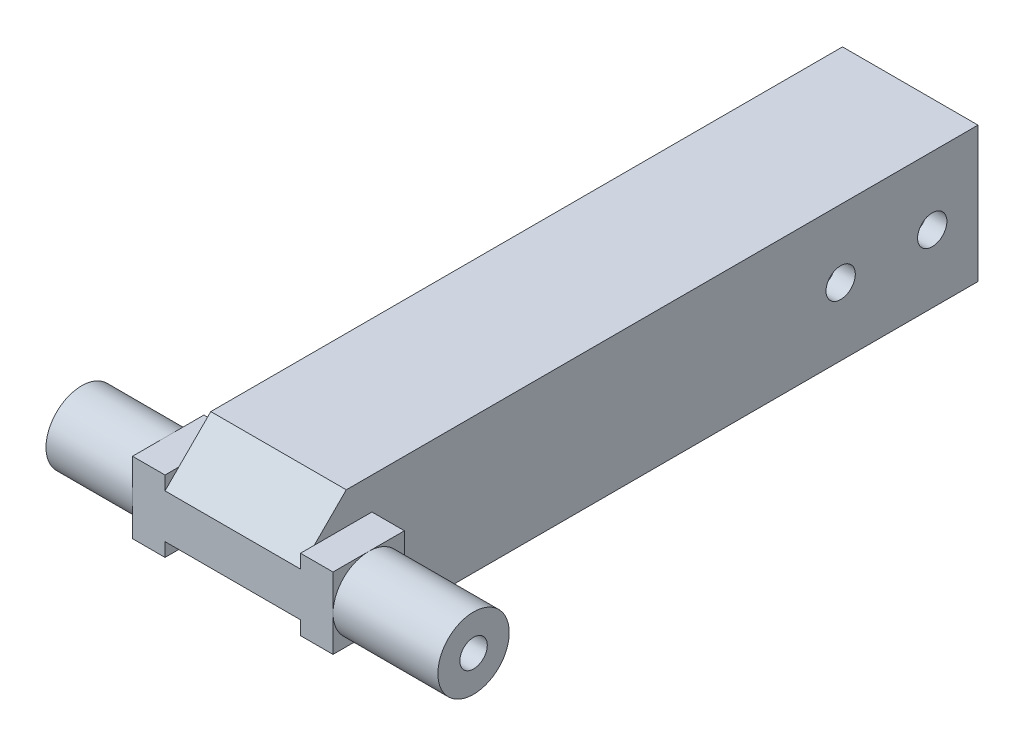
ISO-10303-21;
HEADER;
FILE_DESCRIPTION(('STEP AP214'),'2;1');
FILE_NAME('part.step','',(''),(''),'','','');
FILE_SCHEMA(('AUTOMOTIVE_DESIGN { 1 0 10303 214 1 1 1 1 }'));
ENDSEC;
DATA;
#1=APPLICATION_CONTEXT('core data for automotive mechanical design processes');
#2=APPLICATION_PROTOCOL_DEFINITION('international standard','automotive_design',2000,#1);
#3=PRODUCT_CONTEXT('',#1,'mechanical');
#4=PRODUCT('Part','Part','',(#3));
#5=PRODUCT_RELATED_PRODUCT_CATEGORY('part','',(#4));
#6=PRODUCT_DEFINITION_FORMATION('','',#4);
#7=PRODUCT_DEFINITION_CONTEXT('part definition',#1,'design');
#8=PRODUCT_DEFINITION('design','',#6,#7);
#9=PRODUCT_DEFINITION_SHAPE('','',#8);
#10=(LENGTH_UNIT() NAMED_UNIT(*) SI_UNIT(.MILLI.,.METRE.));
#11=(NAMED_UNIT(*) PLANE_ANGLE_UNIT() SI_UNIT($,.RADIAN.));
#12=(NAMED_UNIT(*) SI_UNIT($,.STERADIAN.) SOLID_ANGLE_UNIT());
#13=UNCERTAINTY_MEASURE_WITH_UNIT(LENGTH_MEASURE(1.E-05),#10,'distance_accuracy_value','');
#14=(GEOMETRIC_REPRESENTATION_CONTEXT(3) GLOBAL_UNCERTAINTY_ASSIGNED_CONTEXT((#13)) GLOBAL_UNIT_ASSIGNED_CONTEXT((#10,
#11,#12)) REPRESENTATION_CONTEXT('',''));
#15=CARTESIAN_POINT('',(0.,0.,0.));
#16=DIRECTION('',(0.,0.,1.));
#17=DIRECTION('',(1.,0.,0.));
#18=AXIS2_PLACEMENT_3D('',#15,#16,#17);
#19=CARTESIAN_POINT('',(14.8,0.,0.));
#20=DIRECTION('',(1.,0.,0.));
#21=DIRECTION('',(0.,0.,-1.));
#22=AXIS2_PLACEMENT_3D('',#19,#20,#21);
#23=PLANE('',#22);
#24=CARTESIAN_POINT('',(14.8,0.,-22.));
#25=DIRECTION('',(1.,0.,0.));
#26=DIRECTION('',(0.,0.,-1.));
#27=AXIS2_PLACEMENT_3D('',#24,#25,#26);
#28=CIRCLE('',#27,1.6);
#29=CARTESIAN_POINT('',(14.8,0.,-23.6));
#30=VERTEX_POINT('',#29);
#31=EDGE_CURVE('E371',#30,#30,#28,.T.);
#32=ORIENTED_EDGE('',*,*,#31,.F.);
#33=EDGE_LOOP('',(#32));
#34=FACE_BOUND('',#33,.T.);
#35=CARTESIAN_POINT('',(14.8,0.,-32.));
#36=DIRECTION('',(1.,0.,0.));
#37=DIRECTION('',(0.,0.,-1.));
#38=AXIS2_PLACEMENT_3D('',#35,#36,#37);
#39=CIRCLE('',#38,1.6);
#40=CARTESIAN_POINT('',(14.8,0.,-33.6));
#41=VERTEX_POINT('',#40);
#42=EDGE_CURVE('E368',#41,#41,#39,.T.);
#43=ORIENTED_EDGE('',*,*,#42,.F.);
#44=EDGE_LOOP('',(#43));
#45=FACE_BOUND('',#44,.T.);
#46=DIRECTION('',(0.,0.707106781186547,-0.707106781186548));
#47=VECTOR('',#46,1.);
#48=CARTESIAN_POINT('',(14.8,19.7,19.6999999999999));
#49=LINE('',#48,#47);
#50=CARTESIAN_POINT('',(14.8,7.4,32.));
#51=VERTEX_POINT('',#50);
#52=CARTESIAN_POINT('',(14.8,3.9,35.5));
#53=VERTEX_POINT('',#52);
#54=EDGE_CURVE('E352',#51,#53,#49,.F.);
#55=ORIENTED_EDGE('',*,*,#54,.T.);
#56=DIRECTION('',(0.,0.,1.));
#57=VECTOR('',#56,1.);
#58=CARTESIAN_POINT('',(14.8,3.89999999999999,37.));
#59=LINE('',#58,#57);
#60=CARTESIAN_POINT('',(14.8,3.89999999999999,29.2));
#61=VERTEX_POINT('',#60);
#62=EDGE_CURVE('E52',#61,#53,#59,.T.);
#63=ORIENTED_EDGE('',*,*,#62,.F.);
#64=DIRECTION('',(0.,1.,0.));
#65=VECTOR('',#64,1.);
#66=CARTESIAN_POINT('',(14.8,-3.89999999999999,29.2));
#67=LINE('',#66,#65);
#68=CARTESIAN_POINT('',(14.8,-3.89999999999999,29.2));
#69=VERTEX_POINT('',#68);
#70=EDGE_CURVE('E56',#69,#61,#67,.T.);
#71=ORIENTED_EDGE('',*,*,#70,.F.);
#72=DIRECTION('',(0.,0.,-1.));
#73=VECTOR('',#72,1.);
#74=CARTESIAN_POINT('',(14.8,-3.9,37.));
#75=LINE('',#74,#73);
#76=CARTESIAN_POINT('',(14.8,-3.89999999999999,35.5));
#77=VERTEX_POINT('',#76);
#78=EDGE_CURVE('E396',#77,#69,#75,.T.);
#79=ORIENTED_EDGE('',*,*,#78,.F.);
#80=DIRECTION('',(0.,0.707106781186549,0.707106781186546));
#81=VECTOR('',#80,1.);
#82=CARTESIAN_POINT('',(14.8,-19.7,19.7000000000001));
#83=LINE('',#82,#81);
#84=CARTESIAN_POINT('',(14.8,-7.4,32.));
#85=VERTEX_POINT('',#84);
#86=EDGE_CURVE('E354',#77,#85,#83,.F.);
#87=ORIENTED_EDGE('',*,*,#86,.T.);
#88=DIRECTION('',(0.,0.,-1.));
#89=VECTOR('',#88,1.);
#90=CARTESIAN_POINT('',(14.8,-7.4,-37.));
#91=LINE('',#90,#89);
#92=CARTESIAN_POINT('',(14.8,-7.4,-37.));
#93=VERTEX_POINT('',#92);
#94=EDGE_CURVE('E318',#85,#93,#91,.T.);
#95=ORIENTED_EDGE('',*,*,#94,.T.);
#96=DIRECTION('',(0.,1.,0.));
#97=VECTOR('',#96,1.);
#98=CARTESIAN_POINT('',(14.8,-7.4,-37.));
#99=LINE('',#98,#97);
#100=CARTESIAN_POINT('',(14.8,7.40000000000001,-37.));
#101=VERTEX_POINT('',#100);
#102=EDGE_CURVE('E320',#93,#101,#99,.T.);
#103=ORIENTED_EDGE('',*,*,#102,.T.);
#104=DIRECTION('',(0.,0.,1.));
#105=VECTOR('',#104,1.);
#106=CARTESIAN_POINT('',(14.8,7.40000000000001,-37.));
#107=LINE('',#106,#105);
#108=EDGE_CURVE('E323',#101,#51,#107,.T.);
#109=ORIENTED_EDGE('',*,*,#108,.T.);
#110=EDGE_LOOP('',(#55,#63,#71,#79,#87,#95,#103,#109));
#111=FACE_BOUND('',#110,.T.);
#112=ADVANCED_FACE('F34',(#34,#45,#111),#23,.T.);
#113=CARTESIAN_POINT('',(0.,0.,0.));
#114=DIRECTION('',(1.,0.,0.));
#115=DIRECTION('',(0.,0.,-1.));
#116=AXIS2_PLACEMENT_3D('',#113,#114,#115);
#117=PLANE('',#116);
#118=CARTESIAN_POINT('',(0.,0.,-22.));
#119=DIRECTION('',(-1.,0.,0.));
#120=DIRECTION('',(0.,0.,1.));
#121=AXIS2_PLACEMENT_3D('',#118,#119,#120);
#122=CIRCLE('',#121,1.6);
#123=CARTESIAN_POINT('',(0.,0.,-20.4));
#124=VERTEX_POINT('',#123);
#125=EDGE_CURVE('E564',#124,#124,#122,.T.);
#126=ORIENTED_EDGE('',*,*,#125,.F.);
#127=EDGE_LOOP('',(#126));
#128=FACE_BOUND('',#127,.T.);
#129=CARTESIAN_POINT('',(0.,0.,-32.));
#130=DIRECTION('',(-1.,0.,0.));
#131=DIRECTION('',(0.,0.,1.));
#132=AXIS2_PLACEMENT_3D('',#129,#130,#131);
#133=CIRCLE('',#132,1.6);
#134=CARTESIAN_POINT('',(0.,0.,-30.4));
#135=VERTEX_POINT('',#134);
#136=EDGE_CURVE('E364',#135,#135,#133,.T.);
#137=ORIENTED_EDGE('',*,*,#136,.F.);
#138=EDGE_LOOP('',(#137));
#139=FACE_BOUND('',#138,.T.);
#140=DIRECTION('',(0.,0.,1.));
#141=VECTOR('',#140,1.);
#142=CARTESIAN_POINT('',(0.,-3.89999999999999,37.));
#143=LINE('',#142,#141);
#144=CARTESIAN_POINT('',(0.,-3.89999999999999,29.2));
#145=VERTEX_POINT('',#144);
#146=CARTESIAN_POINT('',(0.,-3.89999999999999,35.5));
#147=VERTEX_POINT('',#146);
#148=EDGE_CURVE('E257',#145,#147,#143,.T.);
#149=ORIENTED_EDGE('',*,*,#148,.F.);
#150=DIRECTION('',(0.,-1.,0.));
#151=VECTOR('',#150,1.);
#152=CARTESIAN_POINT('',(0.,-3.89999999999999,29.2));
#153=LINE('',#152,#151);
#154=CARTESIAN_POINT('',(0.,3.89999999999999,29.2));
#155=VERTEX_POINT('',#154);
#156=EDGE_CURVE('E252',#155,#145,#153,.T.);
#157=ORIENTED_EDGE('',*,*,#156,.F.);
#158=DIRECTION('',(0.,0.,-1.));
#159=VECTOR('',#158,1.);
#160=CARTESIAN_POINT('',(0.,3.89999999999999,37.));
#161=LINE('',#160,#159);
#162=CARTESIAN_POINT('',(0.,3.89999999999999,35.5));
#163=VERTEX_POINT('',#162);
#164=EDGE_CURVE('E261',#163,#155,#161,.T.);
#165=ORIENTED_EDGE('',*,*,#164,.F.);
#166=DIRECTION('',(0.,-0.707106781186547,0.707106781186548));
#167=VECTOR('',#166,1.);
#168=CARTESIAN_POINT('',(0.,2.39999999999999,37.));
#169=LINE('',#168,#167);
#170=CARTESIAN_POINT('',(0.,7.4,32.));
#171=VERTEX_POINT('',#170);
#172=EDGE_CURVE('E340',#163,#171,#169,.F.);
#173=ORIENTED_EDGE('',*,*,#172,.T.);
#174=DIRECTION('',(0.,0.,1.));
#175=VECTOR('',#174,1.);
#176=CARTESIAN_POINT('',(0.,7.40000000000001,-37.));
#177=LINE('',#176,#175);
#178=CARTESIAN_POINT('',(0.,7.40000000000001,-37.));
#179=VERTEX_POINT('',#178);
#180=EDGE_CURVE('E321',#179,#171,#177,.T.);
#181=ORIENTED_EDGE('',*,*,#180,.F.);
#182=DIRECTION('',(0.,1.,0.));
#183=VECTOR('',#182,1.);
#184=CARTESIAN_POINT('',(0.,-7.4,-37.));
#185=LINE('',#184,#183);
#186=CARTESIAN_POINT('',(0.,-7.4,-37.));
#187=VERTEX_POINT('',#186);
#188=EDGE_CURVE('E328',#187,#179,#185,.T.);
#189=ORIENTED_EDGE('',*,*,#188,.F.);
#190=DIRECTION('',(0.,0.,-1.));
#191=VECTOR('',#190,1.);
#192=CARTESIAN_POINT('',(0.,-7.4,-37.));
#193=LINE('',#192,#191);
#194=CARTESIAN_POINT('',(0.,-7.4,32.));
#195=VERTEX_POINT('',#194);
#196=EDGE_CURVE('E311',#195,#187,#193,.T.);
#197=ORIENTED_EDGE('',*,*,#196,.F.);
#198=DIRECTION('',(0.,-0.707106781186549,-0.707106781186546));
#199=VECTOR('',#198,1.);
#200=CARTESIAN_POINT('',(0.,-7.4,32.));
#201=LINE('',#200,#199);
#202=EDGE_CURVE('E344',#195,#147,#201,.F.);
#203=ORIENTED_EDGE('',*,*,#202,.T.);
#204=EDGE_LOOP('',(#149,#157,#165,#173,#181,#189,#197,#203));
#205=FACE_BOUND('',#204,.T.);
#206=ADVANCED_FACE('F449',(#128,#139,#205),#117,.F.);
#207=CARTESIAN_POINT('',(14.8,-7.4,37.));
#208=DIRECTION('',(0.,0.,-1.));
#209=DIRECTION('',(-1.,0.,0.));
#210=AXIS2_PLACEMENT_3D('',#207,#208,#209);
#211=PLANE('',#210);
#212=DIRECTION('',(1.,0.,0.));
#213=VECTOR('',#212,1.);
#214=CARTESIAN_POINT('',(14.8,-2.39999999999999,37.));
#215=LINE('',#214,#213);
#216=CARTESIAN_POINT('',(0.,-2.39999999999999,37.));
#217=VERTEX_POINT('',#216);
#218=CARTESIAN_POINT('',(14.8,-2.39999999999999,37.));
#219=VERTEX_POINT('',#218);
#220=EDGE_CURVE('E350',#217,#219,#215,.T.);
#221=ORIENTED_EDGE('',*,*,#220,.T.);
#222=DIRECTION('',(0.,-1.,0.));
#223=VECTOR('',#222,1.);
#224=CARTESIAN_POINT('',(14.8,-3.9,37.));
#225=LINE('',#224,#223);
#226=CARTESIAN_POINT('',(14.8,-3.9,37.));
#227=VERTEX_POINT('',#226);
#228=EDGE_CURVE('E397',#219,#227,#225,.T.);
#229=ORIENTED_EDGE('',*,*,#228,.T.);
#230=DIRECTION('',(-1.,0.,0.));
#231=VECTOR('',#230,1.);
#232=CARTESIAN_POINT('',(18.35,-3.9,37.));
#233=LINE('',#232,#231);
#234=CARTESIAN_POINT('',(18.35,-3.9,37.));
#235=VERTEX_POINT('',#234);
#236=EDGE_CURVE('E228',#235,#227,#233,.T.);
#237=ORIENTED_EDGE('',*,*,#236,.F.);
#238=DIRECTION('',(0.,-1.,0.));
#239=VECTOR('',#238,1.);
#240=CARTESIAN_POINT('',(18.35,-3.9,37.));
#241=LINE('',#240,#239);
#242=CARTESIAN_POINT('',(18.35,0.,37.));
#243=VERTEX_POINT('',#242);
#244=EDGE_CURVE('E217',#243,#235,#241,.T.);
#245=ORIENTED_EDGE('',*,*,#244,.F.);
#246=CARTESIAN_POINT('',(18.35,3.89999999999999,37.));
#247=VERTEX_POINT('',#246);
#248=EDGE_CURVE('E382',#247,#243,#241,.T.);
#249=ORIENTED_EDGE('',*,*,#248,.F.);
#250=DIRECTION('',(-1.,0.,0.));
#251=VECTOR('',#250,1.);
#252=CARTESIAN_POINT('',(18.35,3.89999999999999,37.));
#253=LINE('',#252,#251);
#254=CARTESIAN_POINT('',(14.8,3.89999999999999,37.));
#255=VERTEX_POINT('',#254);
#256=EDGE_CURVE('E222',#247,#255,#253,.T.);
#257=ORIENTED_EDGE('',*,*,#256,.T.);
#258=CARTESIAN_POINT('',(14.8,2.39999999999999,37.));
#259=VERTEX_POINT('',#258);
#260=EDGE_CURVE('E393',#255,#259,#225,.T.);
#261=ORIENTED_EDGE('',*,*,#260,.T.);
#262=DIRECTION('',(-1.,0.,0.));
#263=VECTOR('',#262,1.);
#264=CARTESIAN_POINT('',(14.8,2.39999999999999,37.));
#265=LINE('',#264,#263);
#266=CARTESIAN_POINT('',(0.,2.39999999999999,37.));
#267=VERTEX_POINT('',#266);
#268=EDGE_CURVE('E347',#259,#267,#265,.T.);
#269=ORIENTED_EDGE('',*,*,#268,.T.);
#270=DIRECTION('',(0.,1.,0.));
#271=VECTOR('',#270,1.);
#272=CARTESIAN_POINT('',(0.,-3.89999999999999,37.));
#273=LINE('',#272,#271);
#274=CARTESIAN_POINT('',(0.,3.89999999999999,37.));
#275=VERTEX_POINT('',#274);
#276=EDGE_CURVE('E262',#267,#275,#273,.T.);
#277=ORIENTED_EDGE('',*,*,#276,.T.);
#278=DIRECTION('',(1.,0.,0.));
#279=VECTOR('',#278,1.);
#280=CARTESIAN_POINT('',(-3.55,3.89999999999999,37.));
#281=LINE('',#280,#279);
#282=CARTESIAN_POINT('',(-3.55,3.89999999999999,37.));
#283=VERTEX_POINT('',#282);
#284=EDGE_CURVE('E268',#283,#275,#281,.T.);
#285=ORIENTED_EDGE('',*,*,#284,.F.);
#286=DIRECTION('',(0.,1.,0.));
#287=VECTOR('',#286,1.);
#288=CARTESIAN_POINT('',(-3.55,-3.89999999999999,37.));
#289=LINE('',#288,#287);
#290=CARTESIAN_POINT('',(-3.55,0.,37.));
#291=VERTEX_POINT('',#290);
#292=EDGE_CURVE('E244',#291,#283,#289,.T.);
#293=ORIENTED_EDGE('',*,*,#292,.F.);
#294=CARTESIAN_POINT('',(-3.55,-3.89999999999999,37.));
#295=VERTEX_POINT('',#294);
#296=EDGE_CURVE('E245',#295,#291,#289,.T.);
#297=ORIENTED_EDGE('',*,*,#296,.F.);
#298=DIRECTION('',(1.,0.,0.));
#299=VECTOR('',#298,1.);
#300=CARTESIAN_POINT('',(-3.55,-3.89999999999999,37.));
#301=LINE('',#300,#299);
#302=CARTESIAN_POINT('',(0.,-3.89999999999999,37.));
#303=VERTEX_POINT('',#302);
#304=EDGE_CURVE('E271',#295,#303,#301,.T.);
#305=ORIENTED_EDGE('',*,*,#304,.T.);
#306=EDGE_CURVE('E258',#303,#217,#273,.T.);
#307=ORIENTED_EDGE('',*,*,#306,.T.);
#308=EDGE_LOOP('',(#221,#229,#237,#245,#249,#257,#261,#269,#277,#285,#293,#297,#305,#307));
#309=FACE_BOUND('',#308,.T.);
#310=ADVANCED_FACE('F438',(#309),#211,.F.);
#311=CARTESIAN_POINT('',(14.8,-7.4,-37.));
#312=DIRECTION('',(0.,1.,0.));
#313=DIRECTION('',(0.,0.,1.));
#314=AXIS2_PLACEMENT_3D('',#311,#312,#313);
#315=PLANE('',#314);
#316=ORIENTED_EDGE('',*,*,#94,.F.);
#317=DIRECTION('',(-1.,0.,0.));
#318=VECTOR('',#317,1.);
#319=CARTESIAN_POINT('',(14.8,-7.4,32.));
#320=LINE('',#319,#318);
#321=EDGE_CURVE('E337',#85,#195,#320,.T.);
#322=ORIENTED_EDGE('',*,*,#321,.T.);
#323=ORIENTED_EDGE('',*,*,#196,.T.);
#324=DIRECTION('',(-1.,0.,0.));
#325=VECTOR('',#324,1.);
#326=CARTESIAN_POINT('',(14.8,-7.4,-37.));
#327=LINE('',#326,#325);
#328=EDGE_CURVE('E334',#93,#187,#327,.T.);
#329=ORIENTED_EDGE('',*,*,#328,.F.);
#330=EDGE_LOOP('',(#316,#322,#323,#329));
#331=FACE_BOUND('',#330,.T.);
#332=ADVANCED_FACE('F421',(#331),#315,.F.);
#333=CARTESIAN_POINT('',(14.8,-7.4,-37.));
#334=DIRECTION('',(0.,0.,1.));
#335=DIRECTION('',(1.,0.,0.));
#336=AXIS2_PLACEMENT_3D('',#333,#334,#335);
#337=PLANE('',#336);
#338=DIRECTION('',(-1.,0.,0.));
#339=VECTOR('',#338,1.);
#340=CARTESIAN_POINT('',(2.2,-5.19999999999999,-37.));
#341=LINE('',#340,#339);
#342=CARTESIAN_POINT('',(12.6,-5.2,-37.));
#343=VERTEX_POINT('',#342);
#344=CARTESIAN_POINT('',(2.2,-5.19999999999999,-37.));
#345=VERTEX_POINT('',#344);
#346=EDGE_CURVE('E301',#343,#345,#341,.T.);
#347=ORIENTED_EDGE('',*,*,#346,.F.);
#348=DIRECTION('',(0.,-1.,0.));
#349=VECTOR('',#348,1.);
#350=CARTESIAN_POINT('',(12.6,-5.2,-37.));
#351=LINE('',#350,#349);
#352=CARTESIAN_POINT('',(12.6,5.20000000000001,-37.));
#353=VERTEX_POINT('',#352);
#354=EDGE_CURVE('E285',#353,#343,#351,.T.);
#355=ORIENTED_EDGE('',*,*,#354,.F.);
#356=DIRECTION('',(1.,0.,0.));
#357=VECTOR('',#356,1.);
#358=CARTESIAN_POINT('',(2.2,5.20000000000001,-37.));
#359=LINE('',#358,#357);
#360=CARTESIAN_POINT('',(2.2,5.20000000000001,-37.));
#361=VERTEX_POINT('',#360);
#362=EDGE_CURVE('E290',#361,#353,#359,.T.);
#363=ORIENTED_EDGE('',*,*,#362,.F.);
#364=DIRECTION('',(0.,1.,0.));
#365=VECTOR('',#364,1.);
#366=CARTESIAN_POINT('',(2.2,-5.19999999999999,-37.));
#367=LINE('',#366,#365);
#368=EDGE_CURVE('E304',#345,#361,#367,.T.);
#369=ORIENTED_EDGE('',*,*,#368,.F.);
#370=EDGE_LOOP('',(#347,#355,#363,#369));
#371=FACE_BOUND('',#370,.T.);
#372=ORIENTED_EDGE('',*,*,#188,.T.);
#373=DIRECTION('',(-1.,0.,0.));
#374=VECTOR('',#373,1.);
#375=CARTESIAN_POINT('',(14.8,7.40000000000001,-37.));
#376=LINE('',#375,#374);
#377=EDGE_CURVE('E326',#101,#179,#376,.T.);
#378=ORIENTED_EDGE('',*,*,#377,.F.);
#379=ORIENTED_EDGE('',*,*,#102,.F.);
#380=ORIENTED_EDGE('',*,*,#328,.T.);
#381=EDGE_LOOP('',(#372,#378,#379,#380));
#382=FACE_BOUND('',#381,.T.);
#383=ADVANCED_FACE('F427',(#371,#382),#337,.F.);
#384=CARTESIAN_POINT('',(14.8,7.40000000000001,-37.));
#385=DIRECTION('',(0.,-1.,0.));
#386=DIRECTION('',(0.,0.,-1.));
#387=AXIS2_PLACEMENT_3D('',#384,#385,#386);
#388=PLANE('',#387);
#389=ORIENTED_EDGE('',*,*,#180,.T.);
#390=DIRECTION('',(1.,0.,0.));
#391=VECTOR('',#390,1.);
#392=CARTESIAN_POINT('',(14.8,7.4,32.));
#393=LINE('',#392,#391);
#394=EDGE_CURVE('E358',#171,#51,#393,.T.);
#395=ORIENTED_EDGE('',*,*,#394,.T.);
#396=ORIENTED_EDGE('',*,*,#108,.F.);
#397=ORIENTED_EDGE('',*,*,#377,.T.);
#398=EDGE_LOOP('',(#389,#395,#396,#397));
#399=FACE_BOUND('',#398,.T.);
#400=ADVANCED_FACE('F451',(#399),#388,.F.);
#401=CARTESIAN_POINT('',(12.6,-5.2,-7.00000000000001));
#402=DIRECTION('',(1.,0.,0.));
#403=DIRECTION('',(0.,1.,0.));
#404=AXIS2_PLACEMENT_3D('',#401,#402,#403);
#405=PLANE('',#404);
#406=CARTESIAN_POINT('',(12.6,0.,-22.));
#407=DIRECTION('',(1.,0.,0.));
#408=DIRECTION('',(0.,1.,0.));
#409=AXIS2_PLACEMENT_3D('',#406,#407,#408);
#410=CIRCLE('',#409,1.6);
#411=CARTESIAN_POINT('',(12.6,1.6,-22.));
#412=VERTEX_POINT('',#411);
#413=EDGE_CURVE('E376',#412,#412,#410,.T.);
#414=ORIENTED_EDGE('',*,*,#413,.T.);
#415=EDGE_LOOP('',(#414));
#416=FACE_BOUND('',#415,.T.);
#417=CARTESIAN_POINT('',(12.6,0.,-32.));
#418=DIRECTION('',(1.,0.,0.));
#419=DIRECTION('',(0.,1.,0.));
#420=AXIS2_PLACEMENT_3D('',#417,#418,#419);
#421=CIRCLE('',#420,1.6);
#422=CARTESIAN_POINT('',(12.6,1.6,-32.));
#423=VERTEX_POINT('',#422);
#424=EDGE_CURVE('E363',#423,#423,#421,.T.);
#425=ORIENTED_EDGE('',*,*,#424,.T.);
#426=EDGE_LOOP('',(#425));
#427=FACE_BOUND('',#426,.T.);
#428=ORIENTED_EDGE('',*,*,#354,.T.);
#429=DIRECTION('',(0.,0.,-1.));
#430=VECTOR('',#429,1.);
#431=CARTESIAN_POINT('',(12.6,-5.2,-7.00000000000001));
#432=LINE('',#431,#430);
#433=CARTESIAN_POINT('',(12.6,-5.2,-7.00000000000001));
#434=VERTEX_POINT('',#433);
#435=EDGE_CURVE('E299',#434,#343,#432,.T.);
#436=ORIENTED_EDGE('',*,*,#435,.F.);
#437=DIRECTION('',(0.,-1.,0.));
#438=VECTOR('',#437,1.);
#439=CARTESIAN_POINT('',(12.6,-5.2,-7.00000000000001));
#440=LINE('',#439,#438);
#441=CARTESIAN_POINT('',(12.6,5.20000000000001,-7.00000000000001));
#442=VERTEX_POINT('',#441);
#443=EDGE_CURVE('E286',#442,#434,#440,.T.);
#444=ORIENTED_EDGE('',*,*,#443,.F.);
#445=DIRECTION('',(0.,0.,-1.));
#446=VECTOR('',#445,1.);
#447=CARTESIAN_POINT('',(12.6,5.20000000000001,-7.00000000000001));
#448=LINE('',#447,#446);
#449=EDGE_CURVE('E309',#442,#353,#448,.T.);
#450=ORIENTED_EDGE('',*,*,#449,.T.);
#451=EDGE_LOOP('',(#428,#436,#444,#450));
#452=FACE_BOUND('',#451,.T.);
#453=ADVANCED_FACE('F453',(#416,#427,#452),#405,.F.);
#454=CARTESIAN_POINT('',(2.2,5.20000000000001,-7.00000000000001));
#455=DIRECTION('',(0.,1.,0.));
#456=DIRECTION('',(0.,0.,1.));
#457=AXIS2_PLACEMENT_3D('',#454,#455,#456);
#458=PLANE('',#457);
#459=ORIENTED_EDGE('',*,*,#362,.T.);
#460=ORIENTED_EDGE('',*,*,#449,.F.);
#461=DIRECTION('',(1.,0.,0.));
#462=VECTOR('',#461,1.);
#463=CARTESIAN_POINT('',(2.2,5.20000000000001,-7.00000000000001));
#464=LINE('',#463,#462);
#465=CARTESIAN_POINT('',(2.2,5.20000000000001,-7.00000000000001));
#466=VERTEX_POINT('',#465);
#467=EDGE_CURVE('E296',#466,#442,#464,.T.);
#468=ORIENTED_EDGE('',*,*,#467,.F.);
#469=DIRECTION('',(0.,0.,-1.));
#470=VECTOR('',#469,1.);
#471=CARTESIAN_POINT('',(2.2,5.20000000000001,-7.00000000000001));
#472=LINE('',#471,#470);
#473=EDGE_CURVE('E312',#466,#361,#472,.T.);
#474=ORIENTED_EDGE('',*,*,#473,.T.);
#475=EDGE_LOOP('',(#459,#460,#468,#474));
#476=FACE_BOUND('',#475,.T.);
#477=ADVANCED_FACE('F459',(#476),#458,.F.);
#478=CARTESIAN_POINT('',(2.2,-5.19999999999999,-7.00000000000001));
#479=DIRECTION('',(-1.,0.,0.));
#480=DIRECTION('',(0.,0.,1.));
#481=AXIS2_PLACEMENT_3D('',#478,#479,#480);
#482=PLANE('',#481);
#483=CARTESIAN_POINT('',(2.2,0.,-22.));
#484=DIRECTION('',(-1.,0.,0.));
#485=DIRECTION('',(0.,0.,1.));
#486=AXIS2_PLACEMENT_3D('',#483,#484,#485);
#487=CIRCLE('',#486,1.6);
#488=CARTESIAN_POINT('',(2.2,0.,-20.4));
#489=VERTEX_POINT('',#488);
#490=EDGE_CURVE('E38',#489,#489,#487,.T.);
#491=ORIENTED_EDGE('',*,*,#490,.T.);
#492=EDGE_LOOP('',(#491));
#493=FACE_BOUND('',#492,.T.);
#494=CARTESIAN_POINT('',(2.2,0.,-32.));
#495=DIRECTION('',(-1.,0.,0.));
#496=DIRECTION('',(0.,0.,1.));
#497=AXIS2_PLACEMENT_3D('',#494,#495,#496);
#498=CIRCLE('',#497,1.6);
#499=CARTESIAN_POINT('',(2.2,0.,-30.4));
#500=VERTEX_POINT('',#499);
#501=EDGE_CURVE('E361',#500,#500,#498,.T.);
#502=ORIENTED_EDGE('',*,*,#501,.T.);
#503=EDGE_LOOP('',(#502));
#504=FACE_BOUND('',#503,.T.);
#505=ORIENTED_EDGE('',*,*,#368,.T.);
#506=ORIENTED_EDGE('',*,*,#473,.F.);
#507=DIRECTION('',(0.,1.,0.));
#508=VECTOR('',#507,1.);
#509=CARTESIAN_POINT('',(2.2,-5.19999999999999,-7.00000000000001));
#510=LINE('',#509,#508);
#511=CARTESIAN_POINT('',(2.2,-5.19999999999999,-7.00000000000001));
#512=VERTEX_POINT('',#511);
#513=EDGE_CURVE('E293',#512,#466,#510,.T.);
#514=ORIENTED_EDGE('',*,*,#513,.F.);
#515=DIRECTION('',(0.,0.,-1.));
#516=VECTOR('',#515,1.);
#517=CARTESIAN_POINT('',(2.2,-5.19999999999999,-7.00000000000001));
#518=LINE('',#517,#516);
#519=EDGE_CURVE('E314',#512,#345,#518,.T.);
#520=ORIENTED_EDGE('',*,*,#519,.T.);
#521=EDGE_LOOP('',(#505,#506,#514,#520));
#522=FACE_BOUND('',#521,.T.);
#523=ADVANCED_FACE('F479',(#493,#504,#522),#482,.F.);
#524=CARTESIAN_POINT('',(2.2,-5.19999999999999,-7.00000000000001));
#525=DIRECTION('',(0.,-1.,0.));
#526=DIRECTION('',(1.,0.,0.));
#527=AXIS2_PLACEMENT_3D('',#524,#525,#526);
#528=PLANE('',#527);
#529=ORIENTED_EDGE('',*,*,#346,.T.);
#530=ORIENTED_EDGE('',*,*,#519,.F.);
#531=DIRECTION('',(-1.,0.,0.));
#532=VECTOR('',#531,1.);
#533=CARTESIAN_POINT('',(2.2,-5.19999999999999,-7.00000000000001));
#534=LINE('',#533,#532);
#535=EDGE_CURVE('E289',#434,#512,#534,.T.);
#536=ORIENTED_EDGE('',*,*,#535,.F.);
#537=ORIENTED_EDGE('',*,*,#435,.T.);
#538=EDGE_LOOP('',(#529,#530,#536,#537));
#539=FACE_BOUND('',#538,.T.);
#540=ADVANCED_FACE('F475',(#539),#528,.F.);
#541=CARTESIAN_POINT('',(0.,0.,-7.00000000000001));
#542=DIRECTION('',(0.,0.,-1.));
#543=DIRECTION('',(-1.,0.,0.));
#544=AXIS2_PLACEMENT_3D('',#541,#542,#543);
#545=PLANE('',#544);
#546=ORIENTED_EDGE('',*,*,#443,.T.);
#547=ORIENTED_EDGE('',*,*,#535,.T.);
#548=ORIENTED_EDGE('',*,*,#513,.T.);
#549=ORIENTED_EDGE('',*,*,#467,.T.);
#550=EDGE_LOOP('',(#546,#547,#548,#549));
#551=FACE_BOUND('',#550,.T.);
#552=ADVANCED_FACE('F478',(#551),#545,.T.);
#553=CARTESIAN_POINT('',(-13.,0.,33.1));
#554=DIRECTION('',(1.,0.,0.));
#555=DIRECTION('',(0.,0.,-1.));
#556=AXIS2_PLACEMENT_3D('',#553,#554,#555);
#557=CYLINDRICAL_SURFACE('',#556,3.9);
#558=CARTESIAN_POINT('',(-13.,0.,33.1));
#559=DIRECTION('',(-1.,0.,0.));
#560=DIRECTION('',(0.,0.,1.));
#561=AXIS2_PLACEMENT_3D('',#558,#559,#560);
#562=CIRCLE('',#561,3.9);
#563=CARTESIAN_POINT('',(-13.,0.,37.));
#564=VERTEX_POINT('',#563);
#565=EDGE_CURVE('E279',#564,#564,#562,.T.);
#566=ORIENTED_EDGE('',*,*,#565,.F.);
#567=EDGE_LOOP('',(#566));
#568=FACE_BOUND('',#567,.T.);
#569=CARTESIAN_POINT('',(-3.55,0.,33.1));
#570=DIRECTION('',(-1.,0.,0.));
#571=DIRECTION('',(0.,0.,1.));
#572=AXIS2_PLACEMENT_3D('',#569,#570,#571);
#573=CIRCLE('',#572,3.9);
#574=CARTESIAN_POINT('',(-3.55,-3.89999999999999,33.1));
#575=VERTEX_POINT('',#574);
#576=EDGE_CURVE('E360',#575,#291,#573,.T.);
#577=ORIENTED_EDGE('',*,*,#576,.T.);
#578=CARTESIAN_POINT('',(-3.55,3.89999999999999,33.1));
#579=VERTEX_POINT('',#578);
#580=EDGE_CURVE('E11',#291,#579,#573,.T.);
#581=ORIENTED_EDGE('',*,*,#580,.T.);
#582=CARTESIAN_POINT('',(-3.55,0.,29.2));
#583=VERTEX_POINT('',#582);
#584=EDGE_CURVE('E45',#579,#583,#573,.T.);
#585=ORIENTED_EDGE('',*,*,#584,.T.);
#586=EDGE_CURVE('E43',#583,#575,#573,.T.);
#587=ORIENTED_EDGE('',*,*,#586,.T.);
#588=EDGE_LOOP('',(#577,#581,#585,#587));
#589=FACE_BOUND('',#588,.T.);
#590=ADVANCED_FACE('F489',(#568,#589),#557,.T.);
#591=CARTESIAN_POINT('',(-13.,0.,33.1));
#592=DIRECTION('',(-1.,0.,0.));
#593=DIRECTION('',(0.,0.,1.));
#594=AXIS2_PLACEMENT_3D('',#591,#592,#593);
#595=PLANE('',#594);
#596=CARTESIAN_POINT('',(-13.,0.,33.1));
#597=DIRECTION('',(1.,0.,0.));
#598=DIRECTION('',(0.,0.,-1.));
#599=AXIS2_PLACEMENT_3D('',#596,#597,#598);
#600=CIRCLE('',#599,1.5);
#601=CARTESIAN_POINT('',(-13.,0.,31.6));
#602=VERTEX_POINT('',#601);
#603=EDGE_CURVE('E559',#602,#602,#600,.T.);
#604=ORIENTED_EDGE('',*,*,#603,.T.);
#605=EDGE_LOOP('',(#604));
#606=FACE_BOUND('',#605,.T.);
#607=ORIENTED_EDGE('',*,*,#565,.T.);
#608=EDGE_LOOP('',(#607));
#609=FACE_BOUND('',#608,.T.);
#610=ADVANCED_FACE('F502',(#606,#609),#595,.T.);
#611=CARTESIAN_POINT('',(14.8,-7.4,32.));
#612=DIRECTION('',(0.,0.707106781186546,-0.707106781186549));
#613=DIRECTION('',(-1.,0.,0.));
#614=AXIS2_PLACEMENT_3D('',#611,#612,#613);
#615=PLANE('',#614);
#616=EDGE_CURVE('E355',#219,#77,#83,.F.);
#617=ORIENTED_EDGE('',*,*,#616,.F.);
#618=ORIENTED_EDGE('',*,*,#220,.F.);
#619=DIRECTION('',(0.,0.707106781186549,0.707106781186546));
#620=VECTOR('',#619,1.);
#621=CARTESIAN_POINT('',(0.,-7.4,32.));
#622=LINE('',#621,#620);
#623=EDGE_CURVE('E277',#217,#147,#622,.F.);
#624=ORIENTED_EDGE('',*,*,#623,.T.);
#625=ORIENTED_EDGE('',*,*,#202,.F.);
#626=ORIENTED_EDGE('',*,*,#321,.F.);
#627=ORIENTED_EDGE('',*,*,#86,.F.);
#628=EDGE_LOOP('',(#617,#618,#624,#625,#626,#627));
#629=FACE_BOUND('',#628,.T.);
#630=ADVANCED_FACE('F415',(#629),#615,.F.);
#631=CARTESIAN_POINT('',(14.8,2.39999999999999,37.));
#632=DIRECTION('',(0.,-0.707106781186548,-0.707106781186547));
#633=DIRECTION('',(-1.,0.,0.));
#634=AXIS2_PLACEMENT_3D('',#631,#632,#633);
#635=PLANE('',#634);
#636=ORIENTED_EDGE('',*,*,#54,.F.);
#637=ORIENTED_EDGE('',*,*,#394,.F.);
#638=ORIENTED_EDGE('',*,*,#172,.F.);
#639=EDGE_CURVE('E341',#267,#163,#169,.F.);
#640=ORIENTED_EDGE('',*,*,#639,.F.);
#641=ORIENTED_EDGE('',*,*,#268,.F.);
#642=DIRECTION('',(0.,0.707106781186547,-0.707106781186548));
#643=VECTOR('',#642,1.);
#644=CARTESIAN_POINT('',(14.8,2.39999999999999,37.));
#645=LINE('',#644,#643);
#646=EDGE_CURVE('E221',#53,#259,#645,.F.);
#647=ORIENTED_EDGE('',*,*,#646,.F.);
#648=EDGE_LOOP('',(#636,#637,#638,#640,#641,#647));
#649=FACE_BOUND('',#648,.T.);
#650=ADVANCED_FACE('F36',(#649),#635,.F.);
#651=CARTESIAN_POINT('',(-3.55,0.,0.));
#652=DIRECTION('',(-1.,0.,0.));
#653=DIRECTION('',(0.,0.,1.));
#654=AXIS2_PLACEMENT_3D('',#651,#652,#653);
#655=PLANE('',#654);
#656=ORIENTED_EDGE('',*,*,#580,.F.);
#657=ORIENTED_EDGE('',*,*,#292,.T.);
#658=DIRECTION('',(0.,0.,-1.));
#659=VECTOR('',#658,1.);
#660=CARTESIAN_POINT('',(-3.55,3.89999999999999,37.));
#661=LINE('',#660,#659);
#662=EDGE_CURVE('E248',#283,#579,#661,.T.);
#663=ORIENTED_EDGE('',*,*,#662,.T.);
#664=EDGE_LOOP('',(#656,#657,#663));
#665=FACE_BOUND('',#664,.T.);
#666=ADVANCED_FACE('F528',(#665),#655,.T.);
#667=ORIENTED_EDGE('',*,*,#584,.F.);
#668=CARTESIAN_POINT('',(-3.55,3.89999999999999,29.2));
#669=VERTEX_POINT('',#668);
#670=EDGE_CURVE('E247',#579,#669,#661,.T.);
#671=ORIENTED_EDGE('',*,*,#670,.T.);
#672=DIRECTION('',(0.,-1.,0.));
#673=VECTOR('',#672,1.);
#674=CARTESIAN_POINT('',(-3.55,-3.89999999999999,29.2));
#675=LINE('',#674,#673);
#676=EDGE_CURVE('E236',#669,#583,#675,.T.);
#677=ORIENTED_EDGE('',*,*,#676,.T.);
#678=EDGE_LOOP('',(#667,#671,#677));
#679=FACE_BOUND('',#678,.T.);
#680=ADVANCED_FACE('F779',(#679),#655,.T.);
#681=ORIENTED_EDGE('',*,*,#586,.F.);
#682=CARTESIAN_POINT('',(-3.55,-3.89999999999999,29.2));
#683=VERTEX_POINT('',#682);
#684=EDGE_CURVE('E240',#583,#683,#675,.T.);
#685=ORIENTED_EDGE('',*,*,#684,.T.);
#686=DIRECTION('',(0.,0.,1.));
#687=VECTOR('',#686,1.);
#688=CARTESIAN_POINT('',(-3.55,-3.89999999999999,37.));
#689=LINE('',#688,#687);
#690=EDGE_CURVE('E241',#683,#575,#689,.T.);
#691=ORIENTED_EDGE('',*,*,#690,.T.);
#692=EDGE_LOOP('',(#681,#685,#691));
#693=FACE_BOUND('',#692,.T.);
#694=ADVANCED_FACE('F511',(#693),#655,.T.);
#695=CARTESIAN_POINT('',(-3.55,-3.89999999999999,29.2));
#696=DIRECTION('',(0.,0.,1.));
#697=DIRECTION('',(1.,0.,0.));
#698=AXIS2_PLACEMENT_3D('',#695,#696,#697);
#699=PLANE('',#698);
#700=ORIENTED_EDGE('',*,*,#684,.F.);
#701=ORIENTED_EDGE('',*,*,#676,.F.);
#702=DIRECTION('',(1.,0.,0.));
#703=VECTOR('',#702,1.);
#704=CARTESIAN_POINT('',(-3.55,3.89999999999999,29.2));
#705=LINE('',#704,#703);
#706=EDGE_CURVE('E251',#669,#155,#705,.T.);
#707=ORIENTED_EDGE('',*,*,#706,.T.);
#708=ORIENTED_EDGE('',*,*,#156,.T.);
#709=DIRECTION('',(1.,0.,0.));
#710=VECTOR('',#709,1.);
#711=CARTESIAN_POINT('',(-3.55,-3.89999999999999,29.2));
#712=LINE('',#711,#710);
#713=EDGE_CURVE('E274',#683,#145,#712,.T.);
#714=ORIENTED_EDGE('',*,*,#713,.F.);
#715=EDGE_LOOP('',(#700,#701,#707,#708,#714));
#716=FACE_BOUND('',#715,.T.);
#717=ADVANCED_FACE('F507',(#716),#699,.F.);
#718=CARTESIAN_POINT('',(-3.55,-3.89999999999999,37.));
#719=DIRECTION('',(0.,1.,0.));
#720=DIRECTION('',(0.,0.,1.));
#721=AXIS2_PLACEMENT_3D('',#718,#719,#720);
#722=PLANE('',#721);
#723=EDGE_CURVE('E239',#575,#295,#689,.T.);
#724=ORIENTED_EDGE('',*,*,#723,.F.);
#725=ORIENTED_EDGE('',*,*,#690,.F.);
#726=ORIENTED_EDGE('',*,*,#713,.T.);
#727=ORIENTED_EDGE('',*,*,#148,.T.);
#728=EDGE_CURVE('E255',#147,#303,#143,.T.);
#729=ORIENTED_EDGE('',*,*,#728,.T.);
#730=ORIENTED_EDGE('',*,*,#304,.F.);
#731=EDGE_LOOP('',(#724,#725,#726,#727,#729,#730));
#732=FACE_BOUND('',#731,.T.);
#733=ADVANCED_FACE('F510',(#732),#722,.F.);
#734=CARTESIAN_POINT('',(-3.55,3.89999999999999,37.));
#735=DIRECTION('',(0.,-1.,0.));
#736=DIRECTION('',(0.,0.,-1.));
#737=AXIS2_PLACEMENT_3D('',#734,#735,#736);
#738=PLANE('',#737);
#739=ORIENTED_EDGE('',*,*,#670,.F.);
#740=ORIENTED_EDGE('',*,*,#662,.F.);
#741=ORIENTED_EDGE('',*,*,#284,.T.);
#742=EDGE_CURVE('E263',#275,#163,#161,.T.);
#743=ORIENTED_EDGE('',*,*,#742,.T.);
#744=ORIENTED_EDGE('',*,*,#164,.T.);
#745=ORIENTED_EDGE('',*,*,#706,.F.);
#746=EDGE_LOOP('',(#739,#740,#741,#743,#744,#745));
#747=FACE_BOUND('',#746,.T.);
#748=ADVANCED_FACE('F515',(#747),#738,.F.);
#749=CARTESIAN_POINT('',(0.,0.,0.));
#750=DIRECTION('',(-1.,0.,0.));
#751=DIRECTION('',(0.,0.,1.));
#752=AXIS2_PLACEMENT_3D('',#749,#750,#751);
#753=PLANE('',#752);
#754=ORIENTED_EDGE('',*,*,#623,.F.);
#755=ORIENTED_EDGE('',*,*,#306,.F.);
#756=ORIENTED_EDGE('',*,*,#728,.F.);
#757=EDGE_LOOP('',(#754,#755,#756));
#758=FACE_BOUND('',#757,.T.);
#759=ADVANCED_FACE('F446',(#758),#753,.F.);
#760=ORIENTED_EDGE('',*,*,#576,.F.);
#761=ORIENTED_EDGE('',*,*,#723,.T.);
#762=ORIENTED_EDGE('',*,*,#296,.T.);
#763=EDGE_LOOP('',(#760,#761,#762));
#764=FACE_BOUND('',#763,.T.);
#765=ADVANCED_FACE('F523',(#764),#655,.T.);
#766=ORIENTED_EDGE('',*,*,#639,.T.);
#767=ORIENTED_EDGE('',*,*,#742,.F.);
#768=ORIENTED_EDGE('',*,*,#276,.F.);
#769=EDGE_LOOP('',(#766,#767,#768));
#770=FACE_BOUND('',#769,.T.);
#771=ADVANCED_FACE('F520',(#770),#753,.F.);
#772=CARTESIAN_POINT('',(18.35,-3.89999999999999,29.2));
#773=DIRECTION('',(0.,0.,1.));
#774=DIRECTION('',(1.,0.,0.));
#775=AXIS2_PLACEMENT_3D('',#772,#773,#774);
#776=PLANE('',#775);
#777=DIRECTION('',(0.,1.,0.));
#778=VECTOR('',#777,1.);
#779=CARTESIAN_POINT('',(18.35,-3.89999999999999,29.2));
#780=LINE('',#779,#778);
#781=CARTESIAN_POINT('',(18.35,0.,29.2));
#782=VERTEX_POINT('',#781);
#783=CARTESIAN_POINT('',(18.35,3.89999999999999,29.2));
#784=VERTEX_POINT('',#783);
#785=EDGE_CURVE('E198',#782,#784,#780,.T.);
#786=ORIENTED_EDGE('',*,*,#785,.F.);
#787=CARTESIAN_POINT('',(18.35,-3.89999999999999,29.2));
#788=VERTEX_POINT('',#787);
#789=EDGE_CURVE('E207',#788,#782,#780,.T.);
#790=ORIENTED_EDGE('',*,*,#789,.F.);
#791=DIRECTION('',(-1.,0.,0.));
#792=VECTOR('',#791,1.);
#793=CARTESIAN_POINT('',(18.35,-3.89999999999999,29.2));
#794=LINE('',#793,#792);
#795=EDGE_CURVE('E389',#788,#69,#794,.T.);
#796=ORIENTED_EDGE('',*,*,#795,.T.);
#797=ORIENTED_EDGE('',*,*,#70,.T.);
#798=DIRECTION('',(-1.,0.,0.));
#799=VECTOR('',#798,1.);
#800=CARTESIAN_POINT('',(18.35,3.89999999999999,29.2));
#801=LINE('',#800,#799);
#802=EDGE_CURVE('E214',#784,#61,#801,.T.);
#803=ORIENTED_EDGE('',*,*,#802,.F.);
#804=EDGE_LOOP('',(#786,#790,#796,#797,#803));
#805=FACE_BOUND('',#804,.T.);
#806=ADVANCED_FACE('F219',(#805),#776,.F.);
#807=CARTESIAN_POINT('',(18.35,3.89999999999999,37.));
#808=DIRECTION('',(0.,-1.,0.));
#809=DIRECTION('',(0.,0.,-1.));
#810=AXIS2_PLACEMENT_3D('',#807,#808,#809);
#811=PLANE('',#810);
#812=DIRECTION('',(0.,0.,1.));
#813=VECTOR('',#812,1.);
#814=CARTESIAN_POINT('',(18.35,3.89999999999999,37.));
#815=LINE('',#814,#813);
#816=CARTESIAN_POINT('',(18.35,3.89999999999999,33.1));
#817=VERTEX_POINT('',#816);
#818=EDGE_CURVE('E216',#817,#247,#815,.T.);
#819=ORIENTED_EDGE('',*,*,#818,.F.);
#820=EDGE_CURVE('E201',#784,#817,#815,.T.);
#821=ORIENTED_EDGE('',*,*,#820,.F.);
#822=ORIENTED_EDGE('',*,*,#802,.T.);
#823=ORIENTED_EDGE('',*,*,#62,.T.);
#824=EDGE_CURVE('E391',#53,#255,#59,.T.);
#825=ORIENTED_EDGE('',*,*,#824,.T.);
#826=ORIENTED_EDGE('',*,*,#256,.F.);
#827=EDGE_LOOP('',(#819,#821,#822,#823,#825,#826));
#828=FACE_BOUND('',#827,.T.);
#829=ADVANCED_FACE('F213',(#828),#811,.F.);
#830=CARTESIAN_POINT('',(18.35,-3.9,37.));
#831=DIRECTION('',(0.,1.,0.));
#832=DIRECTION('',(0.,0.,1.));
#833=AXIS2_PLACEMENT_3D('',#830,#831,#832);
#834=PLANE('',#833);
#835=DIRECTION('',(0.,0.,-1.));
#836=VECTOR('',#835,1.);
#837=CARTESIAN_POINT('',(18.35,-3.9,37.));
#838=LINE('',#837,#836);
#839=CARTESIAN_POINT('',(18.35,-3.89999999999999,33.1));
#840=VERTEX_POINT('',#839);
#841=EDGE_CURVE('E385',#840,#788,#838,.T.);
#842=ORIENTED_EDGE('',*,*,#841,.F.);
#843=EDGE_CURVE('E386',#235,#840,#838,.T.);
#844=ORIENTED_EDGE('',*,*,#843,.F.);
#845=ORIENTED_EDGE('',*,*,#236,.T.);
#846=EDGE_CURVE('E208',#227,#77,#75,.T.);
#847=ORIENTED_EDGE('',*,*,#846,.T.);
#848=ORIENTED_EDGE('',*,*,#78,.T.);
#849=ORIENTED_EDGE('',*,*,#795,.F.);
#850=EDGE_LOOP('',(#842,#844,#845,#847,#848,#849));
#851=FACE_BOUND('',#850,.T.);
#852=ADVANCED_FACE('F406',(#851),#834,.F.);
#853=CARTESIAN_POINT('',(18.35,0.,0.));
#854=DIRECTION('',(-1.,0.,0.));
#855=DIRECTION('',(0.,0.,1.));
#856=AXIS2_PLACEMENT_3D('',#853,#854,#855);
#857=PLANE('',#856);
#858=ORIENTED_EDGE('',*,*,#248,.T.);
#859=CARTESIAN_POINT('',(18.35,0.,33.1));
#860=DIRECTION('',(-1.,0.,0.));
#861=DIRECTION('',(0.,0.,1.));
#862=AXIS2_PLACEMENT_3D('',#859,#860,#861);
#863=CIRCLE('',#862,3.9);
#864=EDGE_CURVE('E235',#243,#817,#863,.T.);
#865=ORIENTED_EDGE('',*,*,#864,.T.);
#866=ORIENTED_EDGE('',*,*,#818,.T.);
#867=EDGE_LOOP('',(#858,#865,#866));
#868=FACE_BOUND('',#867,.T.);
#869=ADVANCED_FACE('F535',(#868),#857,.F.);
#870=ORIENTED_EDGE('',*,*,#820,.T.);
#871=EDGE_CURVE('E202',#817,#782,#863,.T.);
#872=ORIENTED_EDGE('',*,*,#871,.T.);
#873=ORIENTED_EDGE('',*,*,#785,.T.);
#874=EDGE_LOOP('',(#870,#872,#873));
#875=FACE_BOUND('',#874,.T.);
#876=ADVANCED_FACE('F200',(#875),#857,.F.);
#877=ORIENTED_EDGE('',*,*,#789,.T.);
#878=EDGE_CURVE('E234',#782,#840,#863,.T.);
#879=ORIENTED_EDGE('',*,*,#878,.T.);
#880=ORIENTED_EDGE('',*,*,#841,.T.);
#881=EDGE_LOOP('',(#877,#879,#880));
#882=FACE_BOUND('',#881,.T.);
#883=ADVANCED_FACE('F676',(#882),#857,.F.);
#884=ORIENTED_EDGE('',*,*,#843,.T.);
#885=EDGE_CURVE('E225',#840,#243,#863,.T.);
#886=ORIENTED_EDGE('',*,*,#885,.T.);
#887=ORIENTED_EDGE('',*,*,#244,.T.);
#888=EDGE_LOOP('',(#884,#886,#887));
#889=FACE_BOUND('',#888,.T.);
#890=ADVANCED_FACE('F541',(#889),#857,.F.);
#891=CARTESIAN_POINT('',(14.8,0.,0.));
#892=DIRECTION('',(-1.,0.,0.));
#893=DIRECTION('',(0.,0.,1.));
#894=AXIS2_PLACEMENT_3D('',#891,#892,#893);
#895=PLANE('',#894);
#896=ORIENTED_EDGE('',*,*,#228,.F.);
#897=ORIENTED_EDGE('',*,*,#616,.T.);
#898=ORIENTED_EDGE('',*,*,#846,.F.);
#899=EDGE_LOOP('',(#896,#897,#898));
#900=FACE_BOUND('',#899,.T.);
#901=ADVANCED_FACE('F411',(#900),#895,.T.);
#902=ORIENTED_EDGE('',*,*,#824,.F.);
#903=ORIENTED_EDGE('',*,*,#646,.T.);
#904=ORIENTED_EDGE('',*,*,#260,.F.);
#905=EDGE_LOOP('',(#902,#903,#904));
#906=FACE_BOUND('',#905,.T.);
#907=ADVANCED_FACE('F437',(#906),#895,.T.);
#908=CARTESIAN_POINT('',(29.8,0.,33.1));
#909=DIRECTION('',(-1.,0.,0.));
#910=DIRECTION('',(0.,0.,1.));
#911=AXIS2_PLACEMENT_3D('',#908,#909,#910);
#912=CYLINDRICAL_SURFACE('',#911,3.9);
#913=CARTESIAN_POINT('',(29.8,0.,33.1));
#914=DIRECTION('',(1.,0.,0.));
#915=DIRECTION('',(0.,0.,-1.));
#916=AXIS2_PLACEMENT_3D('',#913,#914,#915);
#917=CIRCLE('',#916,3.9);
#918=CARTESIAN_POINT('',(29.8,0.,29.2));
#919=VERTEX_POINT('',#918);
#920=EDGE_CURVE('E282',#919,#919,#917,.T.);
#921=ORIENTED_EDGE('',*,*,#920,.F.);
#922=EDGE_LOOP('',(#921));
#923=FACE_BOUND('',#922,.T.);
#924=ORIENTED_EDGE('',*,*,#864,.F.);
#925=ORIENTED_EDGE('',*,*,#885,.F.);
#926=ORIENTED_EDGE('',*,*,#878,.F.);
#927=ORIENTED_EDGE('',*,*,#871,.F.);
#928=EDGE_LOOP('',(#924,#925,#926,#927));
#929=FACE_BOUND('',#928,.T.);
#930=ADVANCED_FACE('F491',(#923,#929),#912,.T.);
#931=CARTESIAN_POINT('',(29.8,0.,33.1));
#932=DIRECTION('',(1.,0.,0.));
#933=DIRECTION('',(0.,0.,-1.));
#934=AXIS2_PLACEMENT_3D('',#931,#932,#933);
#935=PLANE('',#934);
#936=CARTESIAN_POINT('',(29.8,0.,33.1));
#937=DIRECTION('',(1.,0.,0.));
#938=DIRECTION('',(0.,0.,-1.));
#939=AXIS2_PLACEMENT_3D('',#936,#937,#938);
#940=CIRCLE('',#939,1.5);
#941=CARTESIAN_POINT('',(29.8,0.,31.6));
#942=VERTEX_POINT('',#941);
#943=EDGE_CURVE('E562',#942,#942,#940,.T.);
#944=ORIENTED_EDGE('',*,*,#943,.F.);
#945=EDGE_LOOP('',(#944));
#946=FACE_BOUND('',#945,.T.);
#947=ORIENTED_EDGE('',*,*,#920,.T.);
#948=EDGE_LOOP('',(#947));
#949=FACE_BOUND('',#948,.T.);
#950=ADVANCED_FACE('F494',(#946,#949),#935,.T.);
#951=CARTESIAN_POINT('',(29.8,0.,-32.));
#952=DIRECTION('',(-1.,0.,0.));
#953=DIRECTION('',(0.,0.,1.));
#954=AXIS2_PLACEMENT_3D('',#951,#952,#953);
#955=CYLINDRICAL_SURFACE('',#954,1.6);
#956=ORIENTED_EDGE('',*,*,#136,.T.);
#957=EDGE_LOOP('',(#956));
#958=FACE_BOUND('',#957,.T.);
#959=ORIENTED_EDGE('',*,*,#501,.F.);
#960=EDGE_LOOP('',(#959));
#961=FACE_BOUND('',#960,.T.);
#962=ADVANCED_FACE('F498',(#958,#961),#955,.F.);
#963=ORIENTED_EDGE('',*,*,#42,.T.);
#964=EDGE_LOOP('',(#963));
#965=FACE_BOUND('',#964,.T.);
#966=ORIENTED_EDGE('',*,*,#424,.F.);
#967=EDGE_LOOP('',(#966));
#968=FACE_BOUND('',#967,.T.);
#969=ADVANCED_FACE('F542',(#965,#968),#955,.F.);
#970=CARTESIAN_POINT('',(29.8,0.,-22.));
#971=DIRECTION('',(-1.,0.,0.));
#972=DIRECTION('',(0.,0.,1.));
#973=AXIS2_PLACEMENT_3D('',#970,#971,#972);
#974=CYLINDRICAL_SURFACE('',#973,1.6);
#975=ORIENTED_EDGE('',*,*,#125,.T.);
#976=EDGE_LOOP('',(#975));
#977=FACE_BOUND('',#976,.T.);
#978=ORIENTED_EDGE('',*,*,#490,.F.);
#979=EDGE_LOOP('',(#978));
#980=FACE_BOUND('',#979,.T.);
#981=ADVANCED_FACE('F545',(#977,#980),#974,.F.);
#982=ORIENTED_EDGE('',*,*,#31,.T.);
#983=EDGE_LOOP('',(#982));
#984=FACE_BOUND('',#983,.T.);
#985=ORIENTED_EDGE('',*,*,#413,.F.);
#986=EDGE_LOOP('',(#985));
#987=FACE_BOUND('',#986,.T.);
#988=ADVANCED_FACE('F547',(#984,#987),#974,.F.);
#989=CARTESIAN_POINT('',(-13.,0.,33.1));
#990=DIRECTION('',(1.,0.,0.));
#991=DIRECTION('',(0.,0.,-1.));
#992=AXIS2_PLACEMENT_3D('',#989,#990,#991);
#993=CYLINDRICAL_SURFACE('',#992,1.5);
#994=ORIENTED_EDGE('',*,*,#603,.F.);
#995=EDGE_LOOP('',(#994));
#996=FACE_BOUND('',#995,.T.);
#997=ORIENTED_EDGE('',*,*,#943,.T.);
#998=EDGE_LOOP('',(#997));
#999=FACE_BOUND('',#998,.T.);
#1000=ADVANCED_FACE('F550',(#996,#999),#993,.F.);
#1001=CLOSED_SHELL('',(#112,#206,#310,#332,#383,#400,#453,#477,#523,#540,#552,#590,#610,#630,
#650,#666,#680,#694,#717,#733,#748,#759,#765,#771,#806,#829,#852,#869,#876,#883,#890,#901,#907,
#930,#950,#962,#969,#981,#988,#1000));
#1002=MANIFOLD_SOLID_BREP('B2',#1001);
#1003=ADVANCED_BREP_SHAPE_REPRESENTATION('',(#18,#1002),#14);
#1004=SHAPE_DEFINITION_REPRESENTATION(#9,#1003);
ENDSEC;
END-ISO-10303-21;
